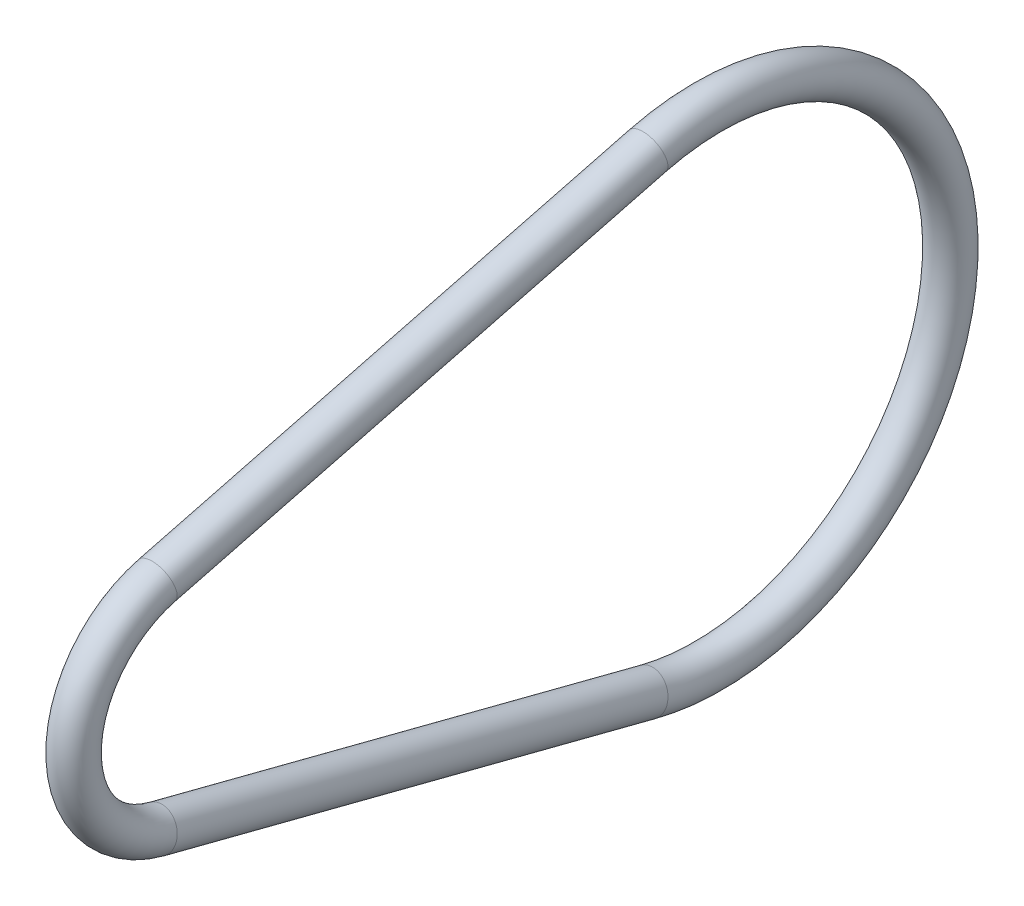
ISO-10303-21;
HEADER;
FILE_DESCRIPTION(('STEP AP214'),'2;1');
FILE_NAME('part.step','',(''),(''),'','','');
FILE_SCHEMA(('AUTOMOTIVE_DESIGN { 1 0 10303 214 1 1 1 1 }'));
ENDSEC;
DATA;
#1=APPLICATION_CONTEXT('core data for automotive mechanical design processes');
#2=APPLICATION_PROTOCOL_DEFINITION('international standard','automotive_design',2000,#1);
#3=PRODUCT_CONTEXT('',#1,'mechanical');
#4=PRODUCT('Part','Part','',(#3));
#5=PRODUCT_RELATED_PRODUCT_CATEGORY('part','',(#4));
#6=PRODUCT_DEFINITION_FORMATION('','',#4);
#7=PRODUCT_DEFINITION_CONTEXT('part definition',#1,'design');
#8=PRODUCT_DEFINITION('design','',#6,#7);
#9=PRODUCT_DEFINITION_SHAPE('','',#8);
#10=(LENGTH_UNIT() NAMED_UNIT(*) SI_UNIT(.MILLI.,.METRE.));
#11=(NAMED_UNIT(*) PLANE_ANGLE_UNIT() SI_UNIT($,.RADIAN.));
#12=(NAMED_UNIT(*) SI_UNIT($,.STERADIAN.) SOLID_ANGLE_UNIT());
#13=UNCERTAINTY_MEASURE_WITH_UNIT(LENGTH_MEASURE(1.E-05),#10,'distance_accuracy_value','');
#14=(GEOMETRIC_REPRESENTATION_CONTEXT(3) GLOBAL_UNCERTAINTY_ASSIGNED_CONTEXT((#13)) GLOBAL_UNIT_ASSIGNED_CONTEXT((#10,
#11,#12)) REPRESENTATION_CONTEXT('',''));
#15=CARTESIAN_POINT('',(0.,0.,0.));
#16=DIRECTION('',(0.,0.,1.));
#17=DIRECTION('',(1.,0.,0.));
#18=AXIS2_PLACEMENT_3D('',#15,#16,#17);
#19=CARTESIAN_POINT('',(364.394917120642,32.3594277571636,-224.243860518351));
#20=DIRECTION('',(0.,0.25,0.968245836551854));
#21=DIRECTION('',(0.,-0.968245836551854,0.25));
#22=AXIS2_PLACEMENT_3D('',#19,#20,#21);
#23=CYLINDRICAL_SURFACE('',#22,0.75);
#24=CARTESIAN_POINT('',(364.394917120642,32.3594277571637,-224.243860518351));
#25=DIRECTION('',(0.,0.250000000000001,0.968245836551854));
#26=DIRECTION('',(0.,-0.968245836551857,0.249999999999989));
#27=AXIS2_PLACEMENT_3D('',#24,#25,#26);
#28=CIRCLE('',#27,0.75);
#29=CARTESIAN_POINT('',(364.394917120642,31.6332433797498,-224.056360518351));
#30=VERTEX_POINT('',#29);
#31=EDGE_CURVE('E27',#30,#30,#28,.F.);
#32=ORIENTED_EDGE('',*,*,#31,.F.);
#33=EDGE_LOOP('',(#32));
#34=FACE_BOUND('',#33,.T.);
#35=CARTESIAN_POINT('',(364.394917120642,37.2006569399229,-205.493860518351));
#36=DIRECTION('',(0.,0.25,0.968245836551854));
#37=DIRECTION('',(0.,-0.968245836551854,0.25));
#38=AXIS2_PLACEMENT_3D('',#35,#36,#37);
#39=CIRCLE('',#38,0.75);
#40=CARTESIAN_POINT('',(364.394917120642,36.474472562509,-205.306360518351));
#41=VERTEX_POINT('',#40);
#42=EDGE_CURVE('E18',#41,#41,#39,.F.);
#43=ORIENTED_EDGE('',*,*,#42,.T.);
#44=EDGE_LOOP('',(#43));
#45=FACE_BOUND('',#44,.T.);
#46=ADVANCED_FACE('F15',(#34,#45),#23,.T.);
#47=CARTESIAN_POINT('',(364.394917120642,41.3157017452683,-206.556360518351));
#48=DIRECTION('',(-1.,0.,0.));
#49=DIRECTION('',(0.,0.,1.));
#50=AXIS2_PLACEMENT_3D('',#47,#48,#49);
#51=TOROIDAL_SURFACE('',#50,4.24999999999998,0.75);
#52=ORIENTED_EDGE('',*,*,#42,.F.);
#53=EDGE_LOOP('',(#52));
#54=FACE_BOUND('',#53,.T.);
#55=CARTESIAN_POINT('',(364.394917120642,45.4307465506136,-205.493860518351));
#56=DIRECTION('',(0.,0.249999999999999,-0.968245836551854));
#57=DIRECTION('',(0.,0.968245836551854,0.249999999999999));
#58=AXIS2_PLACEMENT_3D('',#55,#56,#57);
#59=CIRCLE('',#58,0.75);
#60=CARTESIAN_POINT('',(364.394917120642,46.1569309280275,-205.306360518351));
#61=VERTEX_POINT('',#60);
#62=EDGE_CURVE('E22',#61,#61,#59,.T.);
#63=ORIENTED_EDGE('',*,*,#62,.F.);
#64=EDGE_LOOP('',(#63));
#65=FACE_BOUND('',#64,.T.);
#66=ADVANCED_FACE('F34',(#54,#65),#51,.T.);
#67=CARTESIAN_POINT('',(364.394917120642,45.4307465506136,-205.493860518351));
#68=DIRECTION('',(0.,0.249999999999999,-0.968245836551854));
#69=DIRECTION('',(0.,0.968245836551854,0.249999999999999));
#70=AXIS2_PLACEMENT_3D('',#67,#68,#69);
#71=CYLINDRICAL_SURFACE('',#70,0.75);
#72=CARTESIAN_POINT('',(364.394917120642,50.2719757333729,-224.243860518351));
#73=DIRECTION('',(0.,0.249999999999998,-0.968245836551855));
#74=DIRECTION('',(0.,0.968245836551852,0.250000000000009));
#75=AXIS2_PLACEMENT_3D('',#72,#73,#74);
#76=CIRCLE('',#75,0.75);
#77=CARTESIAN_POINT('',(364.394917120642,50.9981601107868,-224.056360518351));
#78=VERTEX_POINT('',#77);
#79=EDGE_CURVE('E10',#78,#78,#76,.T.);
#80=ORIENTED_EDGE('',*,*,#79,.F.);
#81=EDGE_LOOP('',(#80));
#82=FACE_BOUND('',#81,.T.);
#83=ORIENTED_EDGE('',*,*,#62,.T.);
#84=EDGE_LOOP('',(#83));
#85=FACE_BOUND('',#84,.T.);
#86=ADVANCED_FACE('F37',(#82,#85),#71,.T.);
#87=CARTESIAN_POINT('',(364.394917120642,41.3157017452683,-226.556360518351));
#88=DIRECTION('',(-1.,0.,0.));
#89=DIRECTION('',(0.,0.968245836551855,0.249999999999997));
#90=AXIS2_PLACEMENT_3D('',#87,#88,#89);
#91=TOROIDAL_SURFACE('',#90,9.24999999999997,0.75);
#92=ORIENTED_EDGE('',*,*,#31,.T.);
#93=EDGE_LOOP('',(#92));
#94=FACE_BOUND('',#93,.T.);
#95=ORIENTED_EDGE('',*,*,#79,.T.);
#96=EDGE_LOOP('',(#95));
#97=FACE_BOUND('',#96,.T.);
#98=ADVANCED_FACE('F41',(#94,#97),#91,.T.);
#99=CLOSED_SHELL('',(#46,#66,#86,#98));
#100=MANIFOLD_SOLID_BREP('B1',#99);
#101=ADVANCED_BREP_SHAPE_REPRESENTATION('',(#18,#100),#14);
#102=SHAPE_DEFINITION_REPRESENTATION(#9,#101);
ENDSEC;
END-ISO-10303-21;
